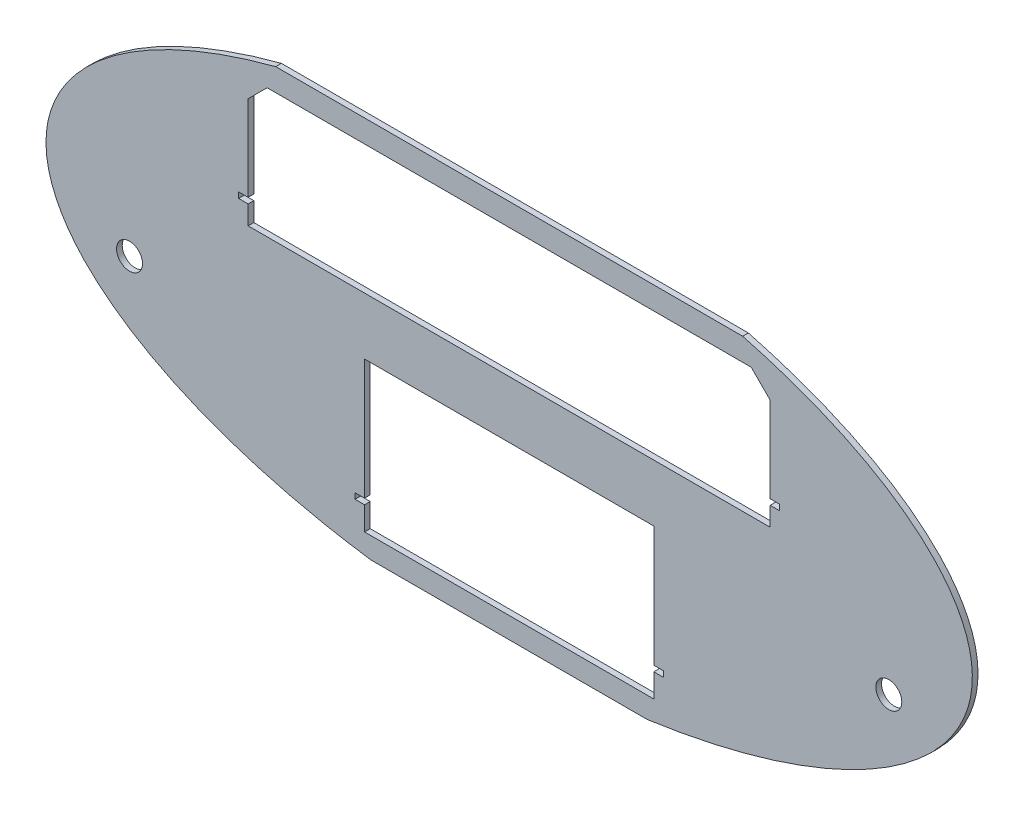
ISO-10303-21;
HEADER;
FILE_DESCRIPTION(('STEP AP214'),'2;1');
FILE_NAME('part.step','',(''),(''),'','','');
FILE_SCHEMA(('AUTOMOTIVE_DESIGN { 1 0 10303 214 1 1 1 1 }'));
ENDSEC;
DATA;
#1=APPLICATION_CONTEXT('core data for automotive mechanical design processes');
#2=APPLICATION_PROTOCOL_DEFINITION('international standard','automotive_design',2000,#1);
#3=PRODUCT_CONTEXT('',#1,'mechanical');
#4=PRODUCT('Part','Part','',(#3));
#5=PRODUCT_RELATED_PRODUCT_CATEGORY('part','',(#4));
#6=PRODUCT_DEFINITION_FORMATION('','',#4);
#7=PRODUCT_DEFINITION_CONTEXT('part definition',#1,'design');
#8=PRODUCT_DEFINITION('design','',#6,#7);
#9=PRODUCT_DEFINITION_SHAPE('','',#8);
#10=(LENGTH_UNIT() NAMED_UNIT(*) SI_UNIT(.MILLI.,.METRE.));
#11=(NAMED_UNIT(*) PLANE_ANGLE_UNIT() SI_UNIT($,.RADIAN.));
#12=(NAMED_UNIT(*) SI_UNIT($,.STERADIAN.) SOLID_ANGLE_UNIT());
#13=UNCERTAINTY_MEASURE_WITH_UNIT(LENGTH_MEASURE(1.E-05),#10,'distance_accuracy_value','');
#14=(GEOMETRIC_REPRESENTATION_CONTEXT(3) GLOBAL_UNCERTAINTY_ASSIGNED_CONTEXT((#13)) GLOBAL_UNIT_ASSIGNED_CONTEXT((#10,
#11,#12)) REPRESENTATION_CONTEXT('',''));
#15=CARTESIAN_POINT('',(0.,0.,0.));
#16=DIRECTION('',(0.,0.,1.));
#17=DIRECTION('',(1.,0.,0.));
#18=AXIS2_PLACEMENT_3D('',#15,#16,#17);
#19=CARTESIAN_POINT('',(0.,0.,-3.));
#20=DIRECTION('',(0.,0.,1.));
#21=DIRECTION('',(1.,0.,0.));
#22=AXIS2_PLACEMENT_3D('',#19,#20,#21);
#23=ELLIPSE('',#22,244.,110.);
#24=DIRECTION('',(0.,0.,1.));
#25=VECTOR('',#24,1.);
#26=SURFACE_OF_LINEAR_EXTRUSION('',#23,#25);
#27=DIRECTION('',(0.,0.,1.));
#28=VECTOR('',#27,1.);
#29=CARTESIAN_POINT('',(-72.7279545422585,-105.,-3.));
#30=LINE('',#29,#28);
#31=CARTESIAN_POINT('',(-72.7279545422585,-105.,0.));
#32=VERTEX_POINT('',#31);
#33=CARTESIAN_POINT('',(-72.7279545422585,-105.,-3.));
#34=VERTEX_POINT('',#33);
#35=EDGE_CURVE('E443',#32,#34,#30,.F.);
#36=ORIENTED_EDGE('',*,*,#35,.F.);
#37=CARTESIAN_POINT('',(0.,0.,0.));
#38=DIRECTION('',(0.,0.,1.));
#39=DIRECTION('',(1.,0.,0.));
#40=AXIS2_PLACEMENT_3D('',#37,#38,#39);
#41=ELLIPSE('',#40,244.,110.);
#42=CARTESIAN_POINT('',(-123.004132161995,95.,0.));
#43=VERTEX_POINT('',#42);
#44=EDGE_CURVE('E463',#43,#32,#41,.T.);
#45=ORIENTED_EDGE('',*,*,#44,.F.);
#46=DIRECTION('',(0.,0.,1.));
#47=VECTOR('',#46,1.);
#48=CARTESIAN_POINT('',(-123.004132161995,95.,-3.));
#49=LINE('',#48,#47);
#50=CARTESIAN_POINT('',(-123.004132161995,95.,-3.));
#51=VERTEX_POINT('',#50);
#52=EDGE_CURVE('E435',#51,#43,#49,.T.);
#53=ORIENTED_EDGE('',*,*,#52,.F.);
#54=EDGE_CURVE('E462',#51,#34,#23,.T.);
#55=ORIENTED_EDGE('',*,*,#54,.T.);
#56=EDGE_LOOP('',(#36,#45,#53,#55));
#57=FACE_BOUND('',#56,.T.);
#58=ADVANCED_FACE('F35',(#57),#26,.T.);
#59=DIRECTION('',(0.,0.,1.));
#60=VECTOR('',#59,1.);
#61=CARTESIAN_POINT('',(72.7279545422587,-105.,-3.));
#62=LINE('',#61,#60);
#63=CARTESIAN_POINT('',(72.7279545422586,-105.,-3.));
#64=VERTEX_POINT('',#63);
#65=CARTESIAN_POINT('',(72.7279545422586,-105.,0.));
#66=VERTEX_POINT('',#65);
#67=EDGE_CURVE('E441',#64,#66,#62,.T.);
#68=ORIENTED_EDGE('',*,*,#67,.F.);
#69=CARTESIAN_POINT('',(123.004132161995,95.,-3.));
#70=VERTEX_POINT('',#69);
#71=EDGE_CURVE('E458',#64,#70,#23,.T.);
#72=ORIENTED_EDGE('',*,*,#71,.T.);
#73=DIRECTION('',(0.,0.,1.));
#74=VECTOR('',#73,1.);
#75=CARTESIAN_POINT('',(123.004132161995,95.,-3.));
#76=LINE('',#75,#74);
#77=CARTESIAN_POINT('',(123.004132161995,95.,0.));
#78=VERTEX_POINT('',#77);
#79=EDGE_CURVE('E439',#78,#70,#76,.F.);
#80=ORIENTED_EDGE('',*,*,#79,.F.);
#81=EDGE_CURVE('E449',#66,#78,#41,.T.);
#82=ORIENTED_EDGE('',*,*,#81,.F.);
#83=EDGE_LOOP('',(#68,#72,#80,#82));
#84=FACE_BOUND('',#83,.T.);
#85=ADVANCED_FACE('F466',(#84),#26,.T.);
#86=CARTESIAN_POINT('',(0.,0.,-3.));
#87=DIRECTION('',(0.,0.,1.));
#88=DIRECTION('',(1.,0.,0.));
#89=AXIS2_PLACEMENT_3D('',#86,#87,#88);
#90=PLANE('',#89);
#91=DIRECTION('',(0.,1.,0.));
#92=VECTOR('',#91,1.);
#93=CARTESIAN_POINT('',(137.5,0.,-3.));
#94=LINE('',#93,#92);
#95=CARTESIAN_POINT('',(137.5,28.1,-3.));
#96=VERTEX_POINT('',#95);
#97=CARTESIAN_POINT('',(137.5,73.1,-3.));
#98=VERTEX_POINT('',#97);
#99=EDGE_CURVE('E328',#96,#98,#94,.T.);
#100=ORIENTED_EDGE('',*,*,#99,.T.);
#101=DIRECTION('',(0.707106781186551,-0.707106781186544,0.));
#102=VECTOR('',#101,1.);
#103=CARTESIAN_POINT('',(105.299999999999,105.3,-3.));
#104=LINE('',#103,#102);
#105=CARTESIAN_POINT('',(127.5,83.1,-3.));
#106=VERTEX_POINT('',#105);
#107=EDGE_CURVE('E519',#98,#106,#104,.F.);
#108=ORIENTED_EDGE('',*,*,#107,.T.);
#109=DIRECTION('',(-1.,0.,0.));
#110=VECTOR('',#109,1.);
#111=CARTESIAN_POINT('',(0.,83.1,-3.));
#112=LINE('',#111,#110);
#113=CARTESIAN_POINT('',(-127.5,83.1,-3.));
#114=VERTEX_POINT('',#113);
#115=EDGE_CURVE('E331',#106,#114,#112,.T.);
#116=ORIENTED_EDGE('',*,*,#115,.T.);
#117=DIRECTION('',(0.707106781186544,0.707106781186551,0.));
#118=VECTOR('',#117,1.);
#119=CARTESIAN_POINT('',(-105.300000000001,105.3,-3.));
#120=LINE('',#119,#118);
#121=CARTESIAN_POINT('',(-137.5,73.1,-3.));
#122=VERTEX_POINT('',#121);
#123=EDGE_CURVE('E11',#114,#122,#120,.F.);
#124=ORIENTED_EDGE('',*,*,#123,.T.);
#125=DIRECTION('',(0.,-1.,0.));
#126=VECTOR('',#125,1.);
#127=CARTESIAN_POINT('',(-137.5,0.,-3.));
#128=LINE('',#127,#126);
#129=CARTESIAN_POINT('',(-137.5,28.1,-3.));
#130=VERTEX_POINT('',#129);
#131=EDGE_CURVE('E333',#122,#130,#128,.T.);
#132=ORIENTED_EDGE('',*,*,#131,.T.);
#133=DIRECTION('',(-1.,0.,0.));
#134=VECTOR('',#133,1.);
#135=CARTESIAN_POINT('',(0.,28.1,-3.));
#136=LINE('',#135,#134);
#137=CARTESIAN_POINT('',(-142.5,28.1,-3.));
#138=VERTEX_POINT('',#137);
#139=EDGE_CURVE('E290',#130,#138,#136,.T.);
#140=ORIENTED_EDGE('',*,*,#139,.T.);
#141=DIRECTION('',(0.,-1.,0.));
#142=VECTOR('',#141,1.);
#143=CARTESIAN_POINT('',(-142.5,0.,-3.));
#144=LINE('',#143,#142);
#145=CARTESIAN_POINT('',(-142.5,25.1,-3.));
#146=VERTEX_POINT('',#145);
#147=EDGE_CURVE('E239',#138,#146,#144,.T.);
#148=ORIENTED_EDGE('',*,*,#147,.T.);
#149=DIRECTION('',(1.,0.,0.));
#150=VECTOR('',#149,1.);
#151=CARTESIAN_POINT('',(0.,25.1,-3.));
#152=LINE('',#151,#150);
#153=CARTESIAN_POINT('',(-137.5,25.1,-3.));
#154=VERTEX_POINT('',#153);
#155=EDGE_CURVE('E307',#146,#154,#152,.T.);
#156=ORIENTED_EDGE('',*,*,#155,.T.);
#157=DIRECTION('',(0.,-1.,0.));
#158=VECTOR('',#157,1.);
#159=CARTESIAN_POINT('',(-137.5,0.,-3.));
#160=LINE('',#159,#158);
#161=CARTESIAN_POINT('',(-137.5,15.1,-3.));
#162=VERTEX_POINT('',#161);
#163=EDGE_CURVE('E310',#154,#162,#160,.T.);
#164=ORIENTED_EDGE('',*,*,#163,.T.);
#165=DIRECTION('',(1.,0.,0.));
#166=VECTOR('',#165,1.);
#167=CARTESIAN_POINT('',(0.,15.1,-3.));
#168=LINE('',#167,#166);
#169=CARTESIAN_POINT('',(137.5,15.1,-3.));
#170=VERTEX_POINT('',#169);
#171=EDGE_CURVE('E313',#162,#170,#168,.T.);
#172=ORIENTED_EDGE('',*,*,#171,.T.);
#173=DIRECTION('',(0.,1.,0.));
#174=VECTOR('',#173,1.);
#175=CARTESIAN_POINT('',(137.5,0.,-3.));
#176=LINE('',#175,#174);
#177=CARTESIAN_POINT('',(137.5,25.1,-3.));
#178=VERTEX_POINT('',#177);
#179=EDGE_CURVE('E316',#170,#178,#176,.T.);
#180=ORIENTED_EDGE('',*,*,#179,.T.);
#181=DIRECTION('',(1.,0.,0.));
#182=VECTOR('',#181,1.);
#183=CARTESIAN_POINT('',(0.,25.1,-3.));
#184=LINE('',#183,#182);
#185=CARTESIAN_POINT('',(142.5,25.1,-3.));
#186=VERTEX_POINT('',#185);
#187=EDGE_CURVE('E319',#178,#186,#184,.T.);
#188=ORIENTED_EDGE('',*,*,#187,.T.);
#189=DIRECTION('',(0.,1.,0.));
#190=VECTOR('',#189,1.);
#191=CARTESIAN_POINT('',(142.5,0.,-3.));
#192=LINE('',#191,#190);
#193=CARTESIAN_POINT('',(142.5,28.1,-3.));
#194=VERTEX_POINT('',#193);
#195=EDGE_CURVE('E322',#186,#194,#192,.T.);
#196=ORIENTED_EDGE('',*,*,#195,.T.);
#197=DIRECTION('',(-1.,0.,0.));
#198=VECTOR('',#197,1.);
#199=CARTESIAN_POINT('',(0.,28.1,-3.));
#200=LINE('',#199,#198);
#201=EDGE_CURVE('E325',#194,#96,#200,.T.);
#202=ORIENTED_EDGE('',*,*,#201,.T.);
#203=EDGE_LOOP('',(#100,#108,#116,#124,#132,#140,#148,#156,#164,#172,#180,#188,#196,#202));
#204=FACE_BOUND('',#203,.T.);
#205=DIRECTION('',(-1.,0.,0.));
#206=VECTOR('',#205,1.);
#207=CARTESIAN_POINT('',(0.,-15.,-3.));
#208=LINE('',#207,#206);
#209=CARTESIAN_POINT('',(76.2,-15.,-3.));
#210=VERTEX_POINT('',#209);
#211=CARTESIAN_POINT('',(-76.2,-15.,-3.));
#212=VERTEX_POINT('',#211);
#213=EDGE_CURVE('E425',#210,#212,#208,.T.);
#214=ORIENTED_EDGE('',*,*,#213,.T.);
#215=DIRECTION('',(0.,-1.,0.));
#216=VECTOR('',#215,1.);
#217=CARTESIAN_POINT('',(-76.2,0.,-3.));
#218=LINE('',#217,#216);
#219=CARTESIAN_POINT('',(-76.2,-78.5,-3.));
#220=VERTEX_POINT('',#219);
#221=EDGE_CURVE('E428',#212,#220,#218,.T.);
#222=ORIENTED_EDGE('',*,*,#221,.T.);
#223=DIRECTION('',(-1.,0.,0.));
#224=VECTOR('',#223,1.);
#225=CARTESIAN_POINT('',(0.,-78.5,-3.));
#226=LINE('',#225,#224);
#227=CARTESIAN_POINT('',(-81.2,-78.5,-3.));
#228=VERTEX_POINT('',#227);
#229=EDGE_CURVE('E373',#220,#228,#226,.T.);
#230=ORIENTED_EDGE('',*,*,#229,.T.);
#231=DIRECTION('',(0.,-1.,0.));
#232=VECTOR('',#231,1.);
#233=CARTESIAN_POINT('',(-81.2,0.,-3.));
#234=LINE('',#233,#232);
#235=CARTESIAN_POINT('',(-81.2,-81.5,-3.));
#236=VERTEX_POINT('',#235);
#237=EDGE_CURVE('E398',#228,#236,#234,.T.);
#238=ORIENTED_EDGE('',*,*,#237,.T.);
#239=DIRECTION('',(1.,0.,0.));
#240=VECTOR('',#239,1.);
#241=CARTESIAN_POINT('',(0.,-81.5,-3.));
#242=LINE('',#241,#240);
#243=CARTESIAN_POINT('',(-76.2,-81.5,-3.));
#244=VERTEX_POINT('',#243);
#245=EDGE_CURVE('E401',#236,#244,#242,.T.);
#246=ORIENTED_EDGE('',*,*,#245,.T.);
#247=DIRECTION('',(0.,-1.,0.));
#248=VECTOR('',#247,1.);
#249=CARTESIAN_POINT('',(-76.1999999999999,0.,-3.));
#250=LINE('',#249,#248);
#251=CARTESIAN_POINT('',(-76.2,-93.9,-3.));
#252=VERTEX_POINT('',#251);
#253=EDGE_CURVE('E404',#244,#252,#250,.T.);
#254=ORIENTED_EDGE('',*,*,#253,.T.);
#255=DIRECTION('',(1.,0.,0.));
#256=VECTOR('',#255,1.);
#257=CARTESIAN_POINT('',(0.,-93.9,-3.));
#258=LINE('',#257,#256);
#259=CARTESIAN_POINT('',(76.2,-93.9,-3.));
#260=VERTEX_POINT('',#259);
#261=EDGE_CURVE('E407',#252,#260,#258,.T.);
#262=ORIENTED_EDGE('',*,*,#261,.T.);
#263=DIRECTION('',(0.,1.,0.));
#264=VECTOR('',#263,1.);
#265=CARTESIAN_POINT('',(76.1999999999999,0.,-3.));
#266=LINE('',#265,#264);
#267=CARTESIAN_POINT('',(76.2,-81.5,-3.));
#268=VERTEX_POINT('',#267);
#269=EDGE_CURVE('E410',#260,#268,#266,.T.);
#270=ORIENTED_EDGE('',*,*,#269,.T.);
#271=DIRECTION('',(1.,0.,0.));
#272=VECTOR('',#271,1.);
#273=CARTESIAN_POINT('',(0.,-81.5,-3.));
#274=LINE('',#273,#272);
#275=CARTESIAN_POINT('',(81.2,-81.5,-3.));
#276=VERTEX_POINT('',#275);
#277=EDGE_CURVE('E413',#268,#276,#274,.T.);
#278=ORIENTED_EDGE('',*,*,#277,.T.);
#279=DIRECTION('',(0.,1.,0.));
#280=VECTOR('',#279,1.);
#281=CARTESIAN_POINT('',(81.2,0.,-3.));
#282=LINE('',#281,#280);
#283=CARTESIAN_POINT('',(81.2,-78.5,-3.));
#284=VERTEX_POINT('',#283);
#285=EDGE_CURVE('E416',#276,#284,#282,.T.);
#286=ORIENTED_EDGE('',*,*,#285,.T.);
#287=DIRECTION('',(-1.,0.,0.));
#288=VECTOR('',#287,1.);
#289=CARTESIAN_POINT('',(0.,-78.5,-3.));
#290=LINE('',#289,#288);
#291=CARTESIAN_POINT('',(76.2,-78.5,-3.));
#292=VERTEX_POINT('',#291);
#293=EDGE_CURVE('E419',#284,#292,#290,.T.);
#294=ORIENTED_EDGE('',*,*,#293,.T.);
#295=DIRECTION('',(0.,1.,0.));
#296=VECTOR('',#295,1.);
#297=CARTESIAN_POINT('',(76.2,0.,-3.));
#298=LINE('',#297,#296);
#299=EDGE_CURVE('E422',#292,#210,#298,.T.);
#300=ORIENTED_EDGE('',*,*,#299,.T.);
#301=EDGE_LOOP('',(#214,#222,#230,#238,#246,#254,#262,#270,#278,#286,#294,#300));
#302=FACE_BOUND('',#301,.T.);
#303=CARTESIAN_POINT('',(200.,-30.,-3.));
#304=DIRECTION('',(0.,0.,1.));
#305=DIRECTION('',(1.,0.,0.));
#306=AXIS2_PLACEMENT_3D('',#303,#304,#305);
#307=CIRCLE('',#306,6.83635541999999);
#308=CARTESIAN_POINT('',(206.83635542,-30.,-3.));
#309=VERTEX_POINT('',#308);
#310=EDGE_CURVE('E446',#309,#309,#307,.T.);
#311=ORIENTED_EDGE('',*,*,#310,.T.);
#312=EDGE_LOOP('',(#311));
#313=FACE_BOUND('',#312,.T.);
#314=CARTESIAN_POINT('',(-200.,-30.,-3.));
#315=DIRECTION('',(0.,0.,1.));
#316=DIRECTION('',(-1.,0.,0.));
#317=AXIS2_PLACEMENT_3D('',#314,#315,#316);
#318=CIRCLE('',#317,6.83635541999999);
#319=CARTESIAN_POINT('',(-206.83635542,-30.,-3.));
#320=VERTEX_POINT('',#319);
#321=EDGE_CURVE('E453',#320,#320,#318,.T.);
#322=ORIENTED_EDGE('',*,*,#321,.T.);
#323=EDGE_LOOP('',(#322));
#324=FACE_BOUND('',#323,.T.);
#325=ORIENTED_EDGE('',*,*,#71,.F.);
#326=DIRECTION('',(-1.,0.,0.));
#327=VECTOR('',#326,1.);
#328=CARTESIAN_POINT('',(244.,-105.,-3.));
#329=LINE('',#328,#327);
#330=EDGE_CURVE('E432',#64,#34,#329,.T.);
#331=ORIENTED_EDGE('',*,*,#330,.T.);
#332=ORIENTED_EDGE('',*,*,#54,.F.);
#333=DIRECTION('',(1.,0.,0.));
#334=VECTOR('',#333,1.);
#335=CARTESIAN_POINT('',(-244.,95.,-3.));
#336=LINE('',#335,#334);
#337=EDGE_CURVE('E431',#51,#70,#336,.T.);
#338=ORIENTED_EDGE('',*,*,#337,.T.);
#339=EDGE_LOOP('',(#325,#331,#332,#338));
#340=FACE_BOUND('',#339,.T.);
#341=ADVANCED_FACE('F469',(#204,#302,#313,#324,#340),#90,.F.);
#342=CARTESIAN_POINT('',(0.,0.,0.));
#343=DIRECTION('',(0.,0.,1.));
#344=DIRECTION('',(1.,0.,0.));
#345=AXIS2_PLACEMENT_3D('',#342,#343,#344);
#346=PLANE('',#345);
#347=DIRECTION('',(0.,-1.,0.));
#348=VECTOR('',#347,1.);
#349=CARTESIAN_POINT('',(-137.5,83.1,0.));
#350=LINE('',#349,#348);
#351=CARTESIAN_POINT('',(-137.5,73.1,0.));
#352=VERTEX_POINT('',#351);
#353=CARTESIAN_POINT('',(-137.5,28.1,0.));
#354=VERTEX_POINT('',#353);
#355=EDGE_CURVE('E253',#352,#354,#350,.T.);
#356=ORIENTED_EDGE('',*,*,#355,.F.);
#357=DIRECTION('',(-0.707106781186544,-0.707106781186551,0.));
#358=VECTOR('',#357,1.);
#359=CARTESIAN_POINT('',(-137.5,73.1,0.));
#360=LINE('',#359,#358);
#361=CARTESIAN_POINT('',(-127.5,83.1,0.));
#362=VERTEX_POINT('',#361);
#363=EDGE_CURVE('E43',#352,#362,#360,.F.);
#364=ORIENTED_EDGE('',*,*,#363,.T.);
#365=DIRECTION('',(-1.,0.,0.));
#366=VECTOR('',#365,1.);
#367=CARTESIAN_POINT('',(-137.5,83.1,0.));
#368=LINE('',#367,#366);
#369=CARTESIAN_POINT('',(127.5,83.1,0.));
#370=VERTEX_POINT('',#369);
#371=EDGE_CURVE('E285',#370,#362,#368,.T.);
#372=ORIENTED_EDGE('',*,*,#371,.F.);
#373=DIRECTION('',(-0.707106781186551,0.707106781186544,0.));
#374=VECTOR('',#373,1.);
#375=CARTESIAN_POINT('',(127.5,83.1,0.));
#376=LINE('',#375,#374);
#377=CARTESIAN_POINT('',(137.5,73.1,0.));
#378=VERTEX_POINT('',#377);
#379=EDGE_CURVE('E517',#370,#378,#376,.F.);
#380=ORIENTED_EDGE('',*,*,#379,.T.);
#381=DIRECTION('',(0.,1.,0.));
#382=VECTOR('',#381,1.);
#383=CARTESIAN_POINT('',(137.5,83.1,0.));
#384=LINE('',#383,#382);
#385=CARTESIAN_POINT('',(137.5,28.1,0.));
#386=VERTEX_POINT('',#385);
#387=EDGE_CURVE('E282',#386,#378,#384,.T.);
#388=ORIENTED_EDGE('',*,*,#387,.F.);
#389=DIRECTION('',(-1.,0.,0.));
#390=VECTOR('',#389,1.);
#391=CARTESIAN_POINT('',(137.5,28.1,0.));
#392=LINE('',#391,#390);
#393=CARTESIAN_POINT('',(142.5,28.1,0.));
#394=VERTEX_POINT('',#393);
#395=EDGE_CURVE('E279',#394,#386,#392,.T.);
#396=ORIENTED_EDGE('',*,*,#395,.F.);
#397=DIRECTION('',(0.,1.,0.));
#398=VECTOR('',#397,1.);
#399=CARTESIAN_POINT('',(142.5,28.1,0.));
#400=LINE('',#399,#398);
#401=CARTESIAN_POINT('',(142.5,25.1,0.));
#402=VERTEX_POINT('',#401);
#403=EDGE_CURVE('E276',#402,#394,#400,.T.);
#404=ORIENTED_EDGE('',*,*,#403,.F.);
#405=DIRECTION('',(1.,0.,0.));
#406=VECTOR('',#405,1.);
#407=CARTESIAN_POINT('',(142.5,25.1,0.));
#408=LINE('',#407,#406);
#409=CARTESIAN_POINT('',(137.5,25.1,0.));
#410=VERTEX_POINT('',#409);
#411=EDGE_CURVE('E273',#410,#402,#408,.T.);
#412=ORIENTED_EDGE('',*,*,#411,.F.);
#413=DIRECTION('',(0.,1.,0.));
#414=VECTOR('',#413,1.);
#415=CARTESIAN_POINT('',(137.5,25.1,0.));
#416=LINE('',#415,#414);
#417=CARTESIAN_POINT('',(137.5,15.1,0.));
#418=VERTEX_POINT('',#417);
#419=EDGE_CURVE('E270',#418,#410,#416,.T.);
#420=ORIENTED_EDGE('',*,*,#419,.F.);
#421=DIRECTION('',(1.,0.,0.));
#422=VECTOR('',#421,1.);
#423=CARTESIAN_POINT('',(137.5,15.1,0.));
#424=LINE('',#423,#422);
#425=CARTESIAN_POINT('',(-137.5,15.1,0.));
#426=VERTEX_POINT('',#425);
#427=EDGE_CURVE('E267',#426,#418,#424,.T.);
#428=ORIENTED_EDGE('',*,*,#427,.F.);
#429=DIRECTION('',(0.,-1.,0.));
#430=VECTOR('',#429,1.);
#431=CARTESIAN_POINT('',(-137.5,25.1,0.));
#432=LINE('',#431,#430);
#433=CARTESIAN_POINT('',(-137.5,25.1,0.));
#434=VERTEX_POINT('',#433);
#435=EDGE_CURVE('E261',#434,#426,#432,.T.);
#436=ORIENTED_EDGE('',*,*,#435,.F.);
#437=DIRECTION('',(1.,0.,0.));
#438=VECTOR('',#437,1.);
#439=CARTESIAN_POINT('',(-142.5,25.1,0.));
#440=LINE('',#439,#438);
#441=CARTESIAN_POINT('',(-142.5,25.1,0.));
#442=VERTEX_POINT('',#441);
#443=EDGE_CURVE('E259',#442,#434,#440,.T.);
#444=ORIENTED_EDGE('',*,*,#443,.F.);
#445=DIRECTION('',(0.,-1.,0.));
#446=VECTOR('',#445,1.);
#447=CARTESIAN_POINT('',(-142.5,28.1,0.));
#448=LINE('',#447,#446);
#449=CARTESIAN_POINT('',(-142.5,28.1,0.));
#450=VERTEX_POINT('',#449);
#451=EDGE_CURVE('E236',#450,#442,#448,.T.);
#452=ORIENTED_EDGE('',*,*,#451,.F.);
#453=DIRECTION('',(-1.,0.,0.));
#454=VECTOR('',#453,1.);
#455=CARTESIAN_POINT('',(-137.5,28.1,0.));
#456=LINE('',#455,#454);
#457=EDGE_CURVE('E248',#354,#450,#456,.T.);
#458=ORIENTED_EDGE('',*,*,#457,.F.);
#459=EDGE_LOOP('',(#356,#364,#372,#380,#388,#396,#404,#412,#420,#428,#436,#444,#452,#458));
#460=FACE_BOUND('',#459,.T.);
#461=DIRECTION('',(0.,-1.,0.));
#462=VECTOR('',#461,1.);
#463=CARTESIAN_POINT('',(-76.2,-15.,0.));
#464=LINE('',#463,#462);
#465=CARTESIAN_POINT('',(-76.2,-15.,0.));
#466=VERTEX_POINT('',#465);
#467=CARTESIAN_POINT('',(-76.2,-78.5,0.));
#468=VERTEX_POINT('',#467);
#469=EDGE_CURVE('E335',#466,#468,#464,.T.);
#470=ORIENTED_EDGE('',*,*,#469,.F.);
#471=DIRECTION('',(-1.,0.,0.));
#472=VECTOR('',#471,1.);
#473=CARTESIAN_POINT('',(-76.2,-15.,0.));
#474=LINE('',#473,#472);
#475=CARTESIAN_POINT('',(76.2,-15.,0.));
#476=VERTEX_POINT('',#475);
#477=EDGE_CURVE('E367',#476,#466,#474,.T.);
#478=ORIENTED_EDGE('',*,*,#477,.F.);
#479=DIRECTION('',(0.,1.,0.));
#480=VECTOR('',#479,1.);
#481=CARTESIAN_POINT('',(76.2,-15.,0.));
#482=LINE('',#481,#480);
#483=CARTESIAN_POINT('',(76.2,-78.5,0.));
#484=VERTEX_POINT('',#483);
#485=EDGE_CURVE('E364',#484,#476,#482,.T.);
#486=ORIENTED_EDGE('',*,*,#485,.F.);
#487=DIRECTION('',(-1.,0.,0.));
#488=VECTOR('',#487,1.);
#489=CARTESIAN_POINT('',(76.2,-78.5,0.));
#490=LINE('',#489,#488);
#491=CARTESIAN_POINT('',(81.2,-78.5,0.));
#492=VERTEX_POINT('',#491);
#493=EDGE_CURVE('E361',#492,#484,#490,.T.);
#494=ORIENTED_EDGE('',*,*,#493,.F.);
#495=DIRECTION('',(0.,1.,0.));
#496=VECTOR('',#495,1.);
#497=CARTESIAN_POINT('',(81.2,-78.5,0.));
#498=LINE('',#497,#496);
#499=CARTESIAN_POINT('',(81.2,-81.5,0.));
#500=VERTEX_POINT('',#499);
#501=EDGE_CURVE('E358',#500,#492,#498,.T.);
#502=ORIENTED_EDGE('',*,*,#501,.F.);
#503=DIRECTION('',(1.,0.,0.));
#504=VECTOR('',#503,1.);
#505=CARTESIAN_POINT('',(76.2,-81.5,0.));
#506=LINE('',#505,#504);
#507=CARTESIAN_POINT('',(76.2,-81.5,0.));
#508=VERTEX_POINT('',#507);
#509=EDGE_CURVE('E355',#508,#500,#506,.T.);
#510=ORIENTED_EDGE('',*,*,#509,.F.);
#511=DIRECTION('',(0.,1.,0.));
#512=VECTOR('',#511,1.);
#513=CARTESIAN_POINT('',(76.2,-81.5,0.));
#514=LINE('',#513,#512);
#515=CARTESIAN_POINT('',(76.2,-93.9,0.));
#516=VERTEX_POINT('',#515);
#517=EDGE_CURVE('E352',#516,#508,#514,.T.);
#518=ORIENTED_EDGE('',*,*,#517,.F.);
#519=DIRECTION('',(1.,0.,0.));
#520=VECTOR('',#519,1.);
#521=CARTESIAN_POINT('',(-76.2,-93.9,0.));
#522=LINE('',#521,#520);
#523=CARTESIAN_POINT('',(-76.2,-93.9,0.));
#524=VERTEX_POINT('',#523);
#525=EDGE_CURVE('E349',#524,#516,#522,.T.);
#526=ORIENTED_EDGE('',*,*,#525,.F.);
#527=DIRECTION('',(0.,-1.,0.));
#528=VECTOR('',#527,1.);
#529=CARTESIAN_POINT('',(-76.2,-81.5,0.));
#530=LINE('',#529,#528);
#531=CARTESIAN_POINT('',(-76.2,-81.5,0.));
#532=VERTEX_POINT('',#531);
#533=EDGE_CURVE('E346',#532,#524,#530,.T.);
#534=ORIENTED_EDGE('',*,*,#533,.F.);
#535=DIRECTION('',(1.,0.,0.));
#536=VECTOR('',#535,1.);
#537=CARTESIAN_POINT('',(-81.2,-81.5,0.));
#538=LINE('',#537,#536);
#539=CARTESIAN_POINT('',(-81.2,-81.5,0.));
#540=VERTEX_POINT('',#539);
#541=EDGE_CURVE('E343',#540,#532,#538,.T.);
#542=ORIENTED_EDGE('',*,*,#541,.F.);
#543=DIRECTION('',(0.,-1.,0.));
#544=VECTOR('',#543,1.);
#545=CARTESIAN_POINT('',(-81.2,-78.5,0.));
#546=LINE('',#545,#544);
#547=CARTESIAN_POINT('',(-81.2,-78.5,0.));
#548=VERTEX_POINT('',#547);
#549=EDGE_CURVE('E340',#548,#540,#546,.T.);
#550=ORIENTED_EDGE('',*,*,#549,.F.);
#551=DIRECTION('',(-1.,0.,0.));
#552=VECTOR('',#551,1.);
#553=CARTESIAN_POINT('',(-81.2,-78.5,0.));
#554=LINE('',#553,#552);
#555=EDGE_CURVE('E337',#468,#548,#554,.T.);
#556=ORIENTED_EDGE('',*,*,#555,.F.);
#557=EDGE_LOOP('',(#470,#478,#486,#494,#502,#510,#518,#526,#534,#542,#550,#556));
#558=FACE_BOUND('',#557,.T.);
#559=DIRECTION('',(-1.,0.,0.));
#560=VECTOR('',#559,1.);
#561=CARTESIAN_POINT('',(0.,-105.,0.));
#562=LINE('',#561,#560);
#563=EDGE_CURVE('E497',#66,#32,#562,.T.);
#564=ORIENTED_EDGE('',*,*,#563,.F.);
#565=ORIENTED_EDGE('',*,*,#81,.T.);
#566=DIRECTION('',(1.,0.,0.));
#567=VECTOR('',#566,1.);
#568=CARTESIAN_POINT('',(0.,95.,0.));
#569=LINE('',#568,#567);
#570=EDGE_CURVE('E499',#43,#78,#569,.T.);
#571=ORIENTED_EDGE('',*,*,#570,.F.);
#572=ORIENTED_EDGE('',*,*,#44,.T.);
#573=EDGE_LOOP('',(#564,#565,#571,#572));
#574=FACE_BOUND('',#573,.T.);
#575=CARTESIAN_POINT('',(200.,-30.,0.));
#576=DIRECTION('',(0.,0.,1.));
#577=DIRECTION('',(1.,0.,0.));
#578=AXIS2_PLACEMENT_3D('',#575,#576,#577);
#579=CIRCLE('',#578,6.83635541999999);
#580=CARTESIAN_POINT('',(206.83635542,-30.,0.));
#581=VERTEX_POINT('',#580);
#582=EDGE_CURVE('E450',#581,#581,#579,.T.);
#583=ORIENTED_EDGE('',*,*,#582,.F.);
#584=EDGE_LOOP('',(#583));
#585=FACE_BOUND('',#584,.T.);
#586=CARTESIAN_POINT('',(-200.,-30.,0.));
#587=DIRECTION('',(0.,0.,1.));
#588=DIRECTION('',(-1.,0.,0.));
#589=AXIS2_PLACEMENT_3D('',#586,#587,#588);
#590=CIRCLE('',#589,6.83635541999999);
#591=CARTESIAN_POINT('',(-206.83635542,-30.,0.));
#592=VERTEX_POINT('',#591);
#593=EDGE_CURVE('E445',#592,#592,#590,.T.);
#594=ORIENTED_EDGE('',*,*,#593,.F.);
#595=EDGE_LOOP('',(#594));
#596=FACE_BOUND('',#595,.T.);
#597=ADVANCED_FACE('F255',(#460,#558,#574,#585,#596),#346,.T.);
#598=CARTESIAN_POINT('',(-200.,-30.,-3.));
#599=DIRECTION('',(0.,0.,1.));
#600=DIRECTION('',(1.,0.,0.));
#601=AXIS2_PLACEMENT_3D('',#598,#599,#600);
#602=CYLINDRICAL_SURFACE('',#601,6.83635541999999);
#603=ORIENTED_EDGE('',*,*,#321,.F.);
#604=EDGE_LOOP('',(#603));
#605=FACE_BOUND('',#604,.T.);
#606=ORIENTED_EDGE('',*,*,#593,.T.);
#607=EDGE_LOOP('',(#606));
#608=FACE_BOUND('',#607,.T.);
#609=ADVANCED_FACE('F639',(#605,#608),#602,.F.);
#610=CARTESIAN_POINT('',(200.,-30.,-3.));
#611=DIRECTION('',(0.,0.,1.));
#612=DIRECTION('',(1.,0.,0.));
#613=AXIS2_PLACEMENT_3D('',#610,#611,#612);
#614=CYLINDRICAL_SURFACE('',#613,6.83635541999999);
#615=ORIENTED_EDGE('',*,*,#310,.F.);
#616=EDGE_LOOP('',(#615));
#617=FACE_BOUND('',#616,.T.);
#618=ORIENTED_EDGE('',*,*,#582,.T.);
#619=EDGE_LOOP('',(#618));
#620=FACE_BOUND('',#619,.T.);
#621=ADVANCED_FACE('F636',(#617,#620),#614,.F.);
#622=CARTESIAN_POINT('',(-244.,95.,-3.));
#623=DIRECTION('',(0.,-1.,0.));
#624=DIRECTION('',(0.,0.,-1.));
#625=AXIS2_PLACEMENT_3D('',#622,#623,#624);
#626=PLANE('',#625);
#627=ORIENTED_EDGE('',*,*,#79,.T.);
#628=ORIENTED_EDGE('',*,*,#337,.F.);
#629=ORIENTED_EDGE('',*,*,#52,.T.);
#630=ORIENTED_EDGE('',*,*,#570,.T.);
#631=EDGE_LOOP('',(#627,#628,#629,#630));
#632=FACE_BOUND('',#631,.T.);
#633=ADVANCED_FACE('F504',(#632),#626,.F.);
#634=CARTESIAN_POINT('',(244.,-105.,-3.));
#635=DIRECTION('',(0.,1.,0.));
#636=DIRECTION('',(-1.,0.,0.));
#637=AXIS2_PLACEMENT_3D('',#634,#635,#636);
#638=PLANE('',#637);
#639=ORIENTED_EDGE('',*,*,#35,.T.);
#640=ORIENTED_EDGE('',*,*,#330,.F.);
#641=ORIENTED_EDGE('',*,*,#67,.T.);
#642=ORIENTED_EDGE('',*,*,#563,.T.);
#643=EDGE_LOOP('',(#639,#640,#641,#642));
#644=FACE_BOUND('',#643,.T.);
#645=ADVANCED_FACE('F630',(#644),#638,.F.);
#646=CARTESIAN_POINT('',(-76.2,-15.,-10.));
#647=DIRECTION('',(-1.,0.,0.));
#648=DIRECTION('',(0.,-1.,0.));
#649=AXIS2_PLACEMENT_3D('',#646,#647,#648);
#650=PLANE('',#649);
#651=DIRECTION('',(0.,0.,1.));
#652=VECTOR('',#651,1.);
#653=CARTESIAN_POINT('',(-76.2,-15.,-10.));
#654=LINE('',#653,#652);
#655=EDGE_CURVE('E371',#212,#466,#654,.T.);
#656=ORIENTED_EDGE('',*,*,#655,.T.);
#657=ORIENTED_EDGE('',*,*,#469,.T.);
#658=DIRECTION('',(0.,0.,1.));
#659=VECTOR('',#658,1.);
#660=CARTESIAN_POINT('',(-76.2,-78.5,-10.));
#661=LINE('',#660,#659);
#662=EDGE_CURVE('E370',#220,#468,#661,.T.);
#663=ORIENTED_EDGE('',*,*,#662,.F.);
#664=ORIENTED_EDGE('',*,*,#221,.F.);
#665=EDGE_LOOP('',(#656,#657,#663,#664));
#666=FACE_BOUND('',#665,.T.);
#667=ADVANCED_FACE('F588',(#666),#650,.F.);
#668=CARTESIAN_POINT('',(-76.2,-15.,-10.));
#669=DIRECTION('',(0.,1.,0.));
#670=DIRECTION('',(0.,0.,1.));
#671=AXIS2_PLACEMENT_3D('',#668,#669,#670);
#672=PLANE('',#671);
#673=DIRECTION('',(0.,0.,1.));
#674=VECTOR('',#673,1.);
#675=CARTESIAN_POINT('',(76.2,-15.,-10.));
#676=LINE('',#675,#674);
#677=EDGE_CURVE('E374',#210,#476,#676,.T.);
#678=ORIENTED_EDGE('',*,*,#677,.T.);
#679=ORIENTED_EDGE('',*,*,#477,.T.);
#680=ORIENTED_EDGE('',*,*,#655,.F.);
#681=ORIENTED_EDGE('',*,*,#213,.F.);
#682=EDGE_LOOP('',(#678,#679,#680,#681));
#683=FACE_BOUND('',#682,.T.);
#684=ADVANCED_FACE('F584',(#683),#672,.F.);
#685=CARTESIAN_POINT('',(76.2,-15.,-10.));
#686=DIRECTION('',(1.,0.,0.));
#687=DIRECTION('',(0.,0.,-1.));
#688=AXIS2_PLACEMENT_3D('',#685,#686,#687);
#689=PLANE('',#688);
#690=DIRECTION('',(0.,0.,1.));
#691=VECTOR('',#690,1.);
#692=CARTESIAN_POINT('',(76.2,-78.5,-10.));
#693=LINE('',#692,#691);
#694=EDGE_CURVE('E376',#292,#484,#693,.T.);
#695=ORIENTED_EDGE('',*,*,#694,.T.);
#696=ORIENTED_EDGE('',*,*,#485,.T.);
#697=ORIENTED_EDGE('',*,*,#677,.F.);
#698=ORIENTED_EDGE('',*,*,#299,.F.);
#699=EDGE_LOOP('',(#695,#696,#697,#698));
#700=FACE_BOUND('',#699,.T.);
#701=ADVANCED_FACE('F587',(#700),#689,.F.);
#702=CARTESIAN_POINT('',(76.2,-78.5,-10.));
#703=DIRECTION('',(0.,1.,0.));
#704=DIRECTION('',(0.,0.,1.));
#705=AXIS2_PLACEMENT_3D('',#702,#703,#704);
#706=PLANE('',#705);
#707=DIRECTION('',(0.,0.,1.));
#708=VECTOR('',#707,1.);
#709=CARTESIAN_POINT('',(81.2,-78.5,-10.));
#710=LINE('',#709,#708);
#711=EDGE_CURVE('E378',#284,#492,#710,.T.);
#712=ORIENTED_EDGE('',*,*,#711,.T.);
#713=ORIENTED_EDGE('',*,*,#493,.T.);
#714=ORIENTED_EDGE('',*,*,#694,.F.);
#715=ORIENTED_EDGE('',*,*,#293,.F.);
#716=EDGE_LOOP('',(#712,#713,#714,#715));
#717=FACE_BOUND('',#716,.T.);
#718=ADVANCED_FACE('F592',(#717),#706,.F.);
#719=CARTESIAN_POINT('',(81.2,-78.5,-10.));
#720=DIRECTION('',(1.,0.,0.));
#721=DIRECTION('',(0.,0.,-1.));
#722=AXIS2_PLACEMENT_3D('',#719,#720,#721);
#723=PLANE('',#722);
#724=DIRECTION('',(0.,0.,1.));
#725=VECTOR('',#724,1.);
#726=CARTESIAN_POINT('',(81.2,-81.5,-10.));
#727=LINE('',#726,#725);
#728=EDGE_CURVE('E380',#276,#500,#727,.T.);
#729=ORIENTED_EDGE('',*,*,#728,.T.);
#730=ORIENTED_EDGE('',*,*,#501,.T.);
#731=ORIENTED_EDGE('',*,*,#711,.F.);
#732=ORIENTED_EDGE('',*,*,#285,.F.);
#733=EDGE_LOOP('',(#729,#730,#731,#732));
#734=FACE_BOUND('',#733,.T.);
#735=ADVANCED_FACE('F596',(#734),#723,.F.);
#736=CARTESIAN_POINT('',(76.2,-81.5,-10.));
#737=DIRECTION('',(0.,-1.,0.));
#738=DIRECTION('',(0.,0.,-1.));
#739=AXIS2_PLACEMENT_3D('',#736,#737,#738);
#740=PLANE('',#739);
#741=DIRECTION('',(0.,0.,1.));
#742=VECTOR('',#741,1.);
#743=CARTESIAN_POINT('',(76.2,-81.5,-10.));
#744=LINE('',#743,#742);
#745=EDGE_CURVE('E382',#268,#508,#744,.T.);
#746=ORIENTED_EDGE('',*,*,#745,.T.);
#747=ORIENTED_EDGE('',*,*,#509,.T.);
#748=ORIENTED_EDGE('',*,*,#728,.F.);
#749=ORIENTED_EDGE('',*,*,#277,.F.);
#750=EDGE_LOOP('',(#746,#747,#748,#749));
#751=FACE_BOUND('',#750,.T.);
#752=ADVANCED_FACE('F600',(#751),#740,.F.);
#753=CARTESIAN_POINT('',(76.2,-81.5,-10.));
#754=DIRECTION('',(1.,0.,0.));
#755=DIRECTION('',(0.,1.,0.));
#756=AXIS2_PLACEMENT_3D('',#753,#754,#755);
#757=PLANE('',#756);
#758=DIRECTION('',(0.,0.,1.));
#759=VECTOR('',#758,1.);
#760=CARTESIAN_POINT('',(76.2,-93.9,-10.));
#761=LINE('',#760,#759);
#762=EDGE_CURVE('E384',#260,#516,#761,.T.);
#763=ORIENTED_EDGE('',*,*,#762,.T.);
#764=ORIENTED_EDGE('',*,*,#517,.T.);
#765=ORIENTED_EDGE('',*,*,#745,.F.);
#766=ORIENTED_EDGE('',*,*,#269,.F.);
#767=EDGE_LOOP('',(#763,#764,#765,#766));
#768=FACE_BOUND('',#767,.T.);
#769=ADVANCED_FACE('F604',(#768),#757,.F.);
#770=CARTESIAN_POINT('',(-76.2,-93.9,-10.));
#771=DIRECTION('',(0.,-1.,0.));
#772=DIRECTION('',(0.,0.,-1.));
#773=AXIS2_PLACEMENT_3D('',#770,#771,#772);
#774=PLANE('',#773);
#775=DIRECTION('',(0.,0.,1.));
#776=VECTOR('',#775,1.);
#777=CARTESIAN_POINT('',(-76.2,-93.9,-10.));
#778=LINE('',#777,#776);
#779=EDGE_CURVE('E386',#252,#524,#778,.T.);
#780=ORIENTED_EDGE('',*,*,#779,.T.);
#781=ORIENTED_EDGE('',*,*,#525,.T.);
#782=ORIENTED_EDGE('',*,*,#762,.F.);
#783=ORIENTED_EDGE('',*,*,#261,.F.);
#784=EDGE_LOOP('',(#780,#781,#782,#783));
#785=FACE_BOUND('',#784,.T.);
#786=ADVANCED_FACE('F608',(#785),#774,.F.);
#787=CARTESIAN_POINT('',(-76.2,-81.5,-10.));
#788=DIRECTION('',(-1.,0.,0.));
#789=DIRECTION('',(0.,-1.,0.));
#790=AXIS2_PLACEMENT_3D('',#787,#788,#789);
#791=PLANE('',#790);
#792=DIRECTION('',(0.,0.,1.));
#793=VECTOR('',#792,1.);
#794=CARTESIAN_POINT('',(-76.2,-81.5,-10.));
#795=LINE('',#794,#793);
#796=EDGE_CURVE('E388',#244,#532,#795,.T.);
#797=ORIENTED_EDGE('',*,*,#796,.T.);
#798=ORIENTED_EDGE('',*,*,#533,.T.);
#799=ORIENTED_EDGE('',*,*,#779,.F.);
#800=ORIENTED_EDGE('',*,*,#253,.F.);
#801=EDGE_LOOP('',(#797,#798,#799,#800));
#802=FACE_BOUND('',#801,.T.);
#803=ADVANCED_FACE('F612',(#802),#791,.F.);
#804=CARTESIAN_POINT('',(-81.2,-81.5,-10.));
#805=DIRECTION('',(0.,-1.,0.));
#806=DIRECTION('',(0.,0.,-1.));
#807=AXIS2_PLACEMENT_3D('',#804,#805,#806);
#808=PLANE('',#807);
#809=DIRECTION('',(0.,0.,1.));
#810=VECTOR('',#809,1.);
#811=CARTESIAN_POINT('',(-81.2,-81.5,-10.));
#812=LINE('',#811,#810);
#813=EDGE_CURVE('E390',#236,#540,#812,.T.);
#814=ORIENTED_EDGE('',*,*,#813,.T.);
#815=ORIENTED_EDGE('',*,*,#541,.T.);
#816=ORIENTED_EDGE('',*,*,#796,.F.);
#817=ORIENTED_EDGE('',*,*,#245,.F.);
#818=EDGE_LOOP('',(#814,#815,#816,#817));
#819=FACE_BOUND('',#818,.T.);
#820=ADVANCED_FACE('F616',(#819),#808,.F.);
#821=CARTESIAN_POINT('',(-81.2,-78.5,-10.));
#822=DIRECTION('',(-1.,0.,0.));
#823=DIRECTION('',(0.,0.,1.));
#824=AXIS2_PLACEMENT_3D('',#821,#822,#823);
#825=PLANE('',#824);
#826=DIRECTION('',(0.,0.,1.));
#827=VECTOR('',#826,1.);
#828=CARTESIAN_POINT('',(-81.2,-78.5,-10.));
#829=LINE('',#828,#827);
#830=EDGE_CURVE('E392',#228,#548,#829,.T.);
#831=ORIENTED_EDGE('',*,*,#830,.T.);
#832=ORIENTED_EDGE('',*,*,#549,.T.);
#833=ORIENTED_EDGE('',*,*,#813,.F.);
#834=ORIENTED_EDGE('',*,*,#237,.F.);
#835=EDGE_LOOP('',(#831,#832,#833,#834));
#836=FACE_BOUND('',#835,.T.);
#837=ADVANCED_FACE('F620',(#836),#825,.F.);
#838=CARTESIAN_POINT('',(-81.2,-78.5,-10.));
#839=DIRECTION('',(0.,1.,0.));
#840=DIRECTION('',(0.,0.,1.));
#841=AXIS2_PLACEMENT_3D('',#838,#839,#840);
#842=PLANE('',#841);
#843=ORIENTED_EDGE('',*,*,#662,.T.);
#844=ORIENTED_EDGE('',*,*,#555,.T.);
#845=ORIENTED_EDGE('',*,*,#830,.F.);
#846=ORIENTED_EDGE('',*,*,#229,.F.);
#847=EDGE_LOOP('',(#843,#844,#845,#846));
#848=FACE_BOUND('',#847,.T.);
#849=ADVANCED_FACE('F583',(#848),#842,.F.);
#850=CARTESIAN_POINT('',(-137.5,83.1,-10.));
#851=DIRECTION('',(-1.,0.,0.));
#852=DIRECTION('',(0.,0.,1.));
#853=AXIS2_PLACEMENT_3D('',#850,#851,#852);
#854=PLANE('',#853);
#855=ORIENTED_EDGE('',*,*,#131,.F.);
#856=DIRECTION('',(0.,0.,1.));
#857=VECTOR('',#856,1.);
#858=CARTESIAN_POINT('',(-137.5,73.1,0.));
#859=LINE('',#858,#857);
#860=EDGE_CURVE('E515',#122,#352,#859,.T.);
#861=ORIENTED_EDGE('',*,*,#860,.T.);
#862=ORIENTED_EDGE('',*,*,#355,.T.);
#863=DIRECTION('',(0.,0.,1.));
#864=VECTOR('',#863,1.);
#865=CARTESIAN_POINT('',(-137.5,28.1,-10.));
#866=LINE('',#865,#864);
#867=EDGE_CURVE('E244',#130,#354,#866,.T.);
#868=ORIENTED_EDGE('',*,*,#867,.F.);
#869=EDGE_LOOP('',(#855,#861,#862,#868));
#870=FACE_BOUND('',#869,.T.);
#871=ADVANCED_FACE('F526',(#870),#854,.F.);
#872=CARTESIAN_POINT('',(-137.5,83.1,-10.));
#873=DIRECTION('',(0.,1.,0.));
#874=DIRECTION('',(-1.,0.,0.));
#875=AXIS2_PLACEMENT_3D('',#872,#873,#874);
#876=PLANE('',#875);
#877=ORIENTED_EDGE('',*,*,#115,.F.);
#878=DIRECTION('',(0.,0.,1.));
#879=VECTOR('',#878,1.);
#880=CARTESIAN_POINT('',(127.5,83.1,0.));
#881=LINE('',#880,#879);
#882=EDGE_CURVE('E510',#106,#370,#881,.T.);
#883=ORIENTED_EDGE('',*,*,#882,.T.);
#884=ORIENTED_EDGE('',*,*,#371,.T.);
#885=DIRECTION('',(0.,0.,-1.));
#886=VECTOR('',#885,1.);
#887=CARTESIAN_POINT('',(-127.5,83.1,-3.));
#888=LINE('',#887,#886);
#889=EDGE_CURVE('E506',#362,#114,#888,.T.);
#890=ORIENTED_EDGE('',*,*,#889,.T.);
#891=EDGE_LOOP('',(#877,#883,#884,#890));
#892=FACE_BOUND('',#891,.T.);
#893=ADVANCED_FACE('F523',(#892),#876,.F.);
#894=CARTESIAN_POINT('',(137.5,83.1,-10.));
#895=DIRECTION('',(1.,0.,0.));
#896=DIRECTION('',(0.,0.,-1.));
#897=AXIS2_PLACEMENT_3D('',#894,#895,#896);
#898=PLANE('',#897);
#899=ORIENTED_EDGE('',*,*,#387,.T.);
#900=DIRECTION('',(0.,0.,-1.));
#901=VECTOR('',#900,1.);
#902=CARTESIAN_POINT('',(137.5,73.1,-3.));
#903=LINE('',#902,#901);
#904=EDGE_CURVE('E513',#378,#98,#903,.T.);
#905=ORIENTED_EDGE('',*,*,#904,.T.);
#906=ORIENTED_EDGE('',*,*,#99,.F.);
#907=DIRECTION('',(0.,0.,1.));
#908=VECTOR('',#907,1.);
#909=CARTESIAN_POINT('',(137.5,28.1,-10.));
#910=LINE('',#909,#908);
#911=EDGE_CURVE('E288',#96,#386,#910,.T.);
#912=ORIENTED_EDGE('',*,*,#911,.T.);
#913=EDGE_LOOP('',(#899,#905,#906,#912));
#914=FACE_BOUND('',#913,.T.);
#915=ADVANCED_FACE('F556',(#914),#898,.F.);
#916=CARTESIAN_POINT('',(137.5,28.1,-10.));
#917=DIRECTION('',(0.,1.,0.));
#918=DIRECTION('',(0.,0.,1.));
#919=AXIS2_PLACEMENT_3D('',#916,#917,#918);
#920=PLANE('',#919);
#921=DIRECTION('',(0.,0.,1.));
#922=VECTOR('',#921,1.);
#923=CARTESIAN_POINT('',(142.5,28.1,-10.));
#924=LINE('',#923,#922);
#925=EDGE_CURVE('E291',#194,#394,#924,.T.);
#926=ORIENTED_EDGE('',*,*,#925,.T.);
#927=ORIENTED_EDGE('',*,*,#395,.T.);
#928=ORIENTED_EDGE('',*,*,#911,.F.);
#929=ORIENTED_EDGE('',*,*,#201,.F.);
#930=EDGE_LOOP('',(#926,#927,#928,#929));
#931=FACE_BOUND('',#930,.T.);
#932=ADVANCED_FACE('F553',(#931),#920,.F.);
#933=CARTESIAN_POINT('',(142.5,28.1,-10.));
#934=DIRECTION('',(1.,0.,0.));
#935=DIRECTION('',(0.,0.,-1.));
#936=AXIS2_PLACEMENT_3D('',#933,#934,#935);
#937=PLANE('',#936);
#938=DIRECTION('',(0.,0.,1.));
#939=VECTOR('',#938,1.);
#940=CARTESIAN_POINT('',(142.5,25.1,-10.));
#941=LINE('',#940,#939);
#942=EDGE_CURVE('E293',#186,#402,#941,.T.);
#943=ORIENTED_EDGE('',*,*,#942,.T.);
#944=ORIENTED_EDGE('',*,*,#403,.T.);
#945=ORIENTED_EDGE('',*,*,#925,.F.);
#946=ORIENTED_EDGE('',*,*,#195,.F.);
#947=EDGE_LOOP('',(#943,#944,#945,#946));
#948=FACE_BOUND('',#947,.T.);
#949=ADVANCED_FACE('F548',(#948),#937,.F.);
#950=CARTESIAN_POINT('',(142.5,25.1,-10.));
#951=DIRECTION('',(0.,-1.,0.));
#952=DIRECTION('',(0.,0.,-1.));
#953=AXIS2_PLACEMENT_3D('',#950,#951,#952);
#954=PLANE('',#953);
#955=DIRECTION('',(0.,0.,1.));
#956=VECTOR('',#955,1.);
#957=CARTESIAN_POINT('',(137.5,25.1,-10.));
#958=LINE('',#957,#956);
#959=EDGE_CURVE('E295',#178,#410,#958,.T.);
#960=ORIENTED_EDGE('',*,*,#959,.T.);
#961=ORIENTED_EDGE('',*,*,#411,.T.);
#962=ORIENTED_EDGE('',*,*,#942,.F.);
#963=ORIENTED_EDGE('',*,*,#187,.F.);
#964=EDGE_LOOP('',(#960,#961,#962,#963));
#965=FACE_BOUND('',#964,.T.);
#966=ADVANCED_FACE('F544',(#965),#954,.F.);
#967=CARTESIAN_POINT('',(137.5,25.1,-10.));
#968=DIRECTION('',(1.,0.,0.));
#969=DIRECTION('',(0.,0.,-1.));
#970=AXIS2_PLACEMENT_3D('',#967,#968,#969);
#971=PLANE('',#970);
#972=DIRECTION('',(0.,0.,1.));
#973=VECTOR('',#972,1.);
#974=CARTESIAN_POINT('',(137.5,15.1,-10.));
#975=LINE('',#974,#973);
#976=EDGE_CURVE('E297',#170,#418,#975,.T.);
#977=ORIENTED_EDGE('',*,*,#976,.T.);
#978=ORIENTED_EDGE('',*,*,#419,.T.);
#979=ORIENTED_EDGE('',*,*,#959,.F.);
#980=ORIENTED_EDGE('',*,*,#179,.F.);
#981=EDGE_LOOP('',(#977,#978,#979,#980));
#982=FACE_BOUND('',#981,.T.);
#983=ADVANCED_FACE('F541',(#982),#971,.F.);
#984=CARTESIAN_POINT('',(137.5,15.1,-10.));
#985=DIRECTION('',(0.,-1.,0.));
#986=DIRECTION('',(0.,0.,-1.));
#987=AXIS2_PLACEMENT_3D('',#984,#985,#986);
#988=PLANE('',#987);
#989=DIRECTION('',(0.,0.,1.));
#990=VECTOR('',#989,1.);
#991=CARTESIAN_POINT('',(-137.5,15.1,-10.));
#992=LINE('',#991,#990);
#993=EDGE_CURVE('E299',#162,#426,#992,.T.);
#994=ORIENTED_EDGE('',*,*,#993,.T.);
#995=ORIENTED_EDGE('',*,*,#427,.T.);
#996=ORIENTED_EDGE('',*,*,#976,.F.);
#997=ORIENTED_EDGE('',*,*,#171,.F.);
#998=EDGE_LOOP('',(#994,#995,#996,#997));
#999=FACE_BOUND('',#998,.T.);
#1000=ADVANCED_FACE('F536',(#999),#988,.F.);
#1001=CARTESIAN_POINT('',(-137.5,25.1,-10.));
#1002=DIRECTION('',(-1.,0.,0.));
#1003=DIRECTION('',(0.,0.,1.));
#1004=AXIS2_PLACEMENT_3D('',#1001,#1002,#1003);
#1005=PLANE('',#1004);
#1006=DIRECTION('',(0.,0.,1.));
#1007=VECTOR('',#1006,1.);
#1008=CARTESIAN_POINT('',(-137.5,25.1,-10.));
#1009=LINE('',#1008,#1007);
#1010=EDGE_CURVE('E301',#154,#434,#1009,.T.);
#1011=ORIENTED_EDGE('',*,*,#1010,.T.);
#1012=ORIENTED_EDGE('',*,*,#435,.T.);
#1013=ORIENTED_EDGE('',*,*,#993,.F.);
#1014=ORIENTED_EDGE('',*,*,#163,.F.);
#1015=EDGE_LOOP('',(#1011,#1012,#1013,#1014));
#1016=FACE_BOUND('',#1015,.T.);
#1017=ADVANCED_FACE('F532',(#1016),#1005,.F.);
#1018=CARTESIAN_POINT('',(-142.5,25.1,-10.));
#1019=DIRECTION('',(0.,-1.,0.));
#1020=DIRECTION('',(0.,0.,-1.));
#1021=AXIS2_PLACEMENT_3D('',#1018,#1019,#1020);
#1022=PLANE('',#1021);
#1023=DIRECTION('',(0.,0.,1.));
#1024=VECTOR('',#1023,1.);
#1025=CARTESIAN_POINT('',(-142.5,25.1,-10.));
#1026=LINE('',#1025,#1024);
#1027=EDGE_CURVE('E243',#146,#442,#1026,.T.);
#1028=ORIENTED_EDGE('',*,*,#1027,.T.);
#1029=ORIENTED_EDGE('',*,*,#443,.T.);
#1030=ORIENTED_EDGE('',*,*,#1010,.F.);
#1031=ORIENTED_EDGE('',*,*,#155,.F.);
#1032=EDGE_LOOP('',(#1028,#1029,#1030,#1031));
#1033=FACE_BOUND('',#1032,.T.);
#1034=ADVANCED_FACE('F530',(#1033),#1022,.F.);
#1035=CARTESIAN_POINT('',(-142.5,28.1,-10.));
#1036=DIRECTION('',(-1.,0.,0.));
#1037=DIRECTION('',(0.,0.,1.));
#1038=AXIS2_PLACEMENT_3D('',#1035,#1036,#1037);
#1039=PLANE('',#1038);
#1040=DIRECTION('',(0.,0.,1.));
#1041=VECTOR('',#1040,1.);
#1042=CARTESIAN_POINT('',(-142.5,28.1,-10.));
#1043=LINE('',#1042,#1041);
#1044=EDGE_CURVE('E231',#138,#450,#1043,.T.);
#1045=ORIENTED_EDGE('',*,*,#1044,.T.);
#1046=ORIENTED_EDGE('',*,*,#451,.T.);
#1047=ORIENTED_EDGE('',*,*,#1027,.F.);
#1048=ORIENTED_EDGE('',*,*,#147,.F.);
#1049=EDGE_LOOP('',(#1045,#1046,#1047,#1048));
#1050=FACE_BOUND('',#1049,.T.);
#1051=ADVANCED_FACE('F233',(#1050),#1039,.F.);
#1052=CARTESIAN_POINT('',(-137.5,28.1,-10.));
#1053=DIRECTION('',(0.,1.,0.));
#1054=DIRECTION('',(0.,0.,1.));
#1055=AXIS2_PLACEMENT_3D('',#1052,#1053,#1054);
#1056=PLANE('',#1055);
#1057=ORIENTED_EDGE('',*,*,#867,.T.);
#1058=ORIENTED_EDGE('',*,*,#457,.T.);
#1059=ORIENTED_EDGE('',*,*,#1044,.F.);
#1060=ORIENTED_EDGE('',*,*,#139,.F.);
#1061=EDGE_LOOP('',(#1057,#1058,#1059,#1060));
#1062=FACE_BOUND('',#1061,.T.);
#1063=ADVANCED_FACE('F249',(#1062),#1056,.F.);
#1064=CARTESIAN_POINT('',(127.5,83.1,-10.));
#1065=DIRECTION('',(-0.707106781186543,-0.707106781186551,0.));
#1066=DIRECTION('',(0.,0.,-1.));
#1067=AXIS2_PLACEMENT_3D('',#1064,#1065,#1066);
#1068=PLANE('',#1067);
#1069=ORIENTED_EDGE('',*,*,#107,.F.);
#1070=ORIENTED_EDGE('',*,*,#904,.F.);
#1071=ORIENTED_EDGE('',*,*,#379,.F.);
#1072=ORIENTED_EDGE('',*,*,#882,.F.);
#1073=EDGE_LOOP('',(#1069,#1070,#1071,#1072));
#1074=FACE_BOUND('',#1073,.T.);
#1075=ADVANCED_FACE('F472',(#1074),#1068,.T.);
#1076=CARTESIAN_POINT('',(-137.5,73.1,-10.));
#1077=DIRECTION('',(0.707106781186551,-0.707106781186544,0.));
#1078=DIRECTION('',(0.,0.,-1.));
#1079=AXIS2_PLACEMENT_3D('',#1076,#1077,#1078);
#1080=PLANE('',#1079);
#1081=ORIENTED_EDGE('',*,*,#123,.F.);
#1082=ORIENTED_EDGE('',*,*,#889,.F.);
#1083=ORIENTED_EDGE('',*,*,#363,.F.);
#1084=ORIENTED_EDGE('',*,*,#860,.F.);
#1085=EDGE_LOOP('',(#1081,#1082,#1083,#1084));
#1086=FACE_BOUND('',#1085,.T.);
#1087=ADVANCED_FACE('F37',(#1086),#1080,.T.);
#1088=CLOSED_SHELL('',(#58,#85,#341,#597,#609,#621,#633,#645,#667,#684,#701,#718,#735,#752,#769,
#786,#803,#820,#837,#849,#871,#893,#915,#932,#949,#966,#983,#1000,#1017,#1034,#1051,#1063,#1075,#1087));
#1089=MANIFOLD_SOLID_BREP('B2',#1088);
#1090=ADVANCED_BREP_SHAPE_REPRESENTATION('',(#18,#1089),#14);
#1091=SHAPE_DEFINITION_REPRESENTATION(#9,#1090);
ENDSEC;
END-ISO-10303-21;
